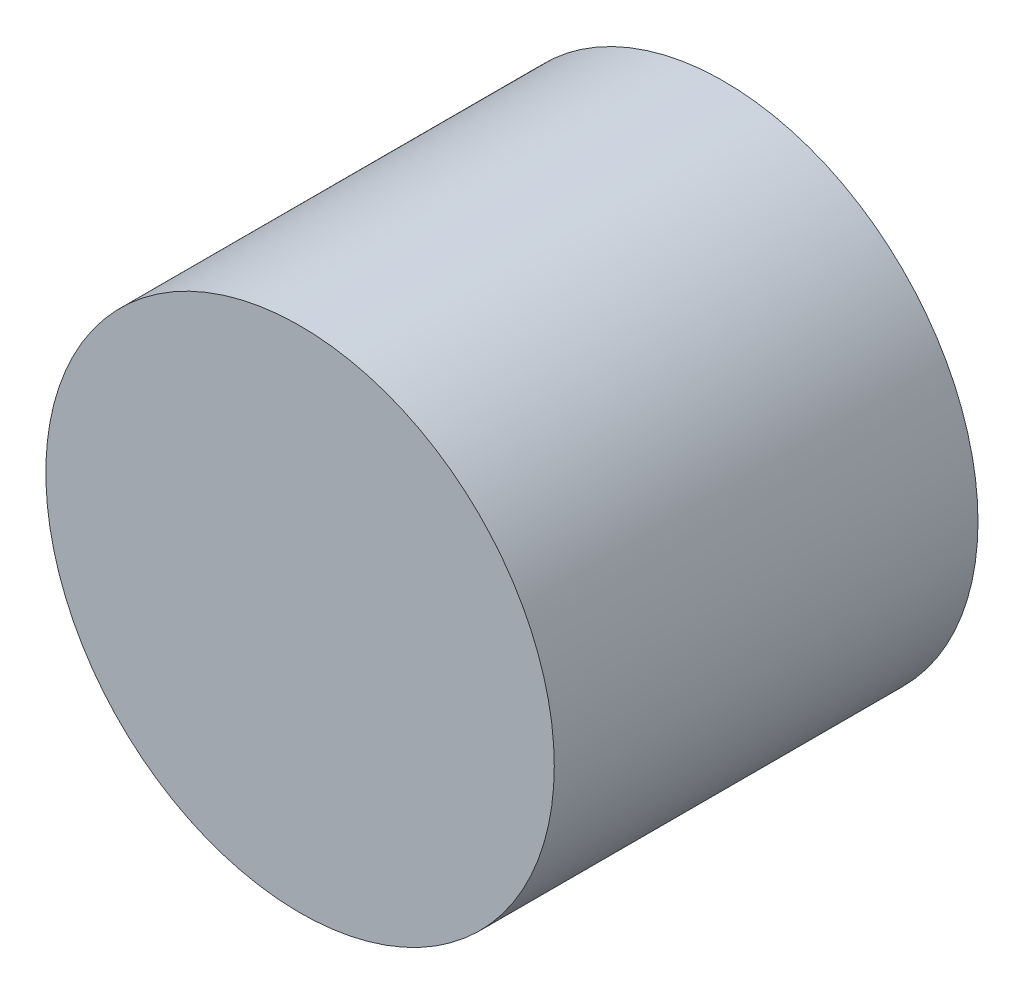
ISO-10303-21;
HEADER;
FILE_DESCRIPTION(('STEP AP214'),'2;1');
FILE_NAME('part.step','',(''),(''),'','','');
FILE_SCHEMA(('AUTOMOTIVE_DESIGN { 1 0 10303 214 1 1 1 1 }'));
ENDSEC;
DATA;
#1=APPLICATION_CONTEXT('core data for automotive mechanical design processes');
#2=APPLICATION_PROTOCOL_DEFINITION('international standard','automotive_design',2000,#1);
#3=PRODUCT_CONTEXT('',#1,'mechanical');
#4=PRODUCT('Part','Part','',(#3));
#5=PRODUCT_RELATED_PRODUCT_CATEGORY('part','',(#4));
#6=PRODUCT_DEFINITION_FORMATION('','',#4);
#7=PRODUCT_DEFINITION_CONTEXT('part definition',#1,'design');
#8=PRODUCT_DEFINITION('design','',#6,#7);
#9=PRODUCT_DEFINITION_SHAPE('','',#8);
#10=(LENGTH_UNIT() NAMED_UNIT(*) SI_UNIT(.MILLI.,.METRE.));
#11=(NAMED_UNIT(*) PLANE_ANGLE_UNIT() SI_UNIT($,.RADIAN.));
#12=(NAMED_UNIT(*) SI_UNIT($,.STERADIAN.) SOLID_ANGLE_UNIT());
#13=UNCERTAINTY_MEASURE_WITH_UNIT(LENGTH_MEASURE(1.E-05),#10,'distance_accuracy_value','');
#14=(GEOMETRIC_REPRESENTATION_CONTEXT(3) GLOBAL_UNCERTAINTY_ASSIGNED_CONTEXT((#13)) GLOBAL_UNIT_ASSIGNED_CONTEXT((#10,
#11,#12)) REPRESENTATION_CONTEXT('',''));
#15=CARTESIAN_POINT('',(0.,0.,0.));
#16=DIRECTION('',(0.,0.,1.));
#17=DIRECTION('',(1.,0.,0.));
#18=AXIS2_PLACEMENT_3D('',#15,#16,#17);
#19=CARTESIAN_POINT('',(0.,0.,10.));
#20=DIRECTION('',(0.,0.,-1.));
#21=DIRECTION('',(-1.,0.,0.));
#22=AXIS2_PLACEMENT_3D('',#19,#20,#21);
#23=CYLINDRICAL_SURFACE('',#22,6.);
#24=CARTESIAN_POINT('',(0.,0.,10.));
#25=DIRECTION('',(0.,0.,1.));
#26=DIRECTION('',(1.,0.,0.));
#27=AXIS2_PLACEMENT_3D('',#24,#25,#26);
#28=CIRCLE('',#27,6.);
#29=CARTESIAN_POINT('',(6.,0.,10.));
#30=VERTEX_POINT('',#29);
#31=EDGE_CURVE('E10',#30,#30,#28,.T.);
#32=ORIENTED_EDGE('',*,*,#31,.F.);
#33=EDGE_LOOP('',(#32));
#34=FACE_BOUND('',#33,.T.);
#35=CARTESIAN_POINT('',(0.,0.,0.));
#36=DIRECTION('',(0.,0.,1.));
#37=DIRECTION('',(1.,0.,0.));
#38=AXIS2_PLACEMENT_3D('',#35,#36,#37);
#39=CIRCLE('',#38,6.);
#40=CARTESIAN_POINT('',(6.,0.,0.));
#41=VERTEX_POINT('',#40);
#42=EDGE_CURVE('E40',#41,#41,#39,.T.);
#43=ORIENTED_EDGE('',*,*,#42,.T.);
#44=EDGE_LOOP('',(#43));
#45=FACE_BOUND('',#44,.T.);
#46=ADVANCED_FACE('F37',(#34,#45),#23,.T.);
#47=CARTESIAN_POINT('',(0.,0.,10.));
#48=DIRECTION('',(0.,0.,1.));
#49=DIRECTION('',(1.,0.,0.));
#50=AXIS2_PLACEMENT_3D('',#47,#48,#49);
#51=PLANE('',#50);
#52=ORIENTED_EDGE('',*,*,#31,.T.);
#53=EDGE_LOOP('',(#52));
#54=FACE_BOUND('',#53,.T.);
#55=ADVANCED_FACE('F52',(#54),#51,.T.);
#56=CARTESIAN_POINT('',(0.,0.,0.));
#57=DIRECTION('',(0.,0.,1.));
#58=DIRECTION('',(1.,0.,0.));
#59=AXIS2_PLACEMENT_3D('',#56,#57,#58);
#60=PLANE('',#59);
#61=ORIENTED_EDGE('',*,*,#42,.F.);
#62=EDGE_LOOP('',(#61));
#63=FACE_BOUND('',#62,.T.);
#64=ADVANCED_FACE('F50',(#63),#60,.F.);
#65=CLOSED_SHELL('',(#46,#55,#64));
#66=MANIFOLD_SOLID_BREP('B2',#65);
#67=ADVANCED_BREP_SHAPE_REPRESENTATION('',(#18,#66),#14);
#68=SHAPE_DEFINITION_REPRESENTATION(#9,#67);
ENDSEC;
END-ISO-10303-21;
